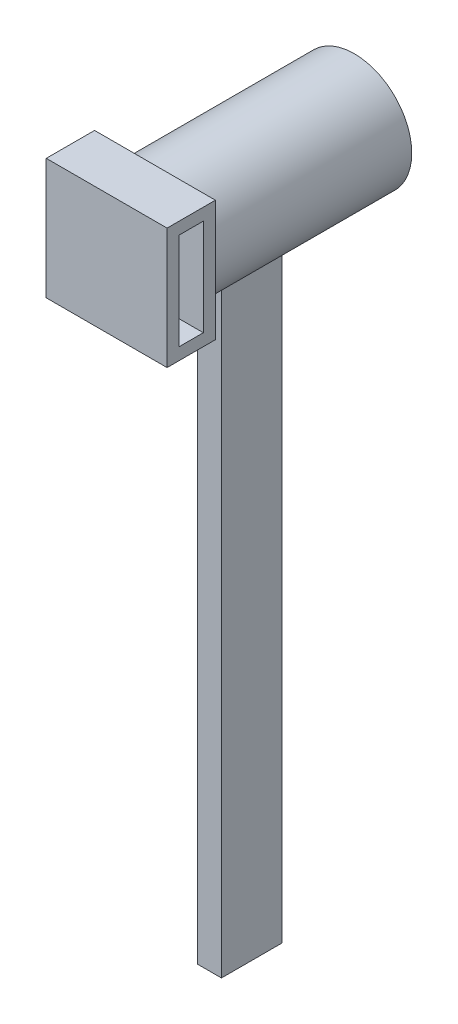
ISO-10303-21;
HEADER;
FILE_DESCRIPTION(('STEP AP214'),'2;1');
FILE_NAME('part.step','',(''),(''),'','','');
FILE_SCHEMA(('AUTOMOTIVE_DESIGN { 1 0 10303 214 1 1 1 1 }'));
ENDSEC;
DATA;
#1=APPLICATION_CONTEXT('core data for automotive mechanical design processes');
#2=APPLICATION_PROTOCOL_DEFINITION('international standard','automotive_design',2000,#1);
#3=PRODUCT_CONTEXT('',#1,'mechanical');
#4=PRODUCT('Part','Part','',(#3));
#5=PRODUCT_RELATED_PRODUCT_CATEGORY('part','',(#4));
#6=PRODUCT_DEFINITION_FORMATION('','',#4);
#7=PRODUCT_DEFINITION_CONTEXT('part definition',#1,'design');
#8=PRODUCT_DEFINITION('design','',#6,#7);
#9=PRODUCT_DEFINITION_SHAPE('','',#8);
#10=(LENGTH_UNIT() NAMED_UNIT(*) SI_UNIT(.MILLI.,.METRE.));
#11=(NAMED_UNIT(*) PLANE_ANGLE_UNIT() SI_UNIT($,.RADIAN.));
#12=(NAMED_UNIT(*) SI_UNIT($,.STERADIAN.) SOLID_ANGLE_UNIT());
#13=UNCERTAINTY_MEASURE_WITH_UNIT(LENGTH_MEASURE(1.E-05),#10,'distance_accuracy_value','');
#14=(GEOMETRIC_REPRESENTATION_CONTEXT(3) GLOBAL_UNCERTAINTY_ASSIGNED_CONTEXT((#13)) GLOBAL_UNIT_ASSIGNED_CONTEXT((#10,
#11,#12)) REPRESENTATION_CONTEXT('',''));
#15=CARTESIAN_POINT('',(0.,0.,0.));
#16=DIRECTION('',(0.,0.,1.));
#17=DIRECTION('',(1.,0.,0.));
#18=AXIS2_PLACEMENT_3D('',#15,#16,#17);
#19=CARTESIAN_POINT('',(0.,0.,0.));
#20=DIRECTION('',(0.,0.,1.));
#21=DIRECTION('',(1.,0.,0.));
#22=AXIS2_PLACEMENT_3D('',#19,#20,#21);
#23=PLANE('',#22);
#24=CARTESIAN_POINT('',(0.,0.,0.));
#25=DIRECTION('',(0.,0.,1.));
#26=DIRECTION('',(1.,0.,0.));
#27=AXIS2_PLACEMENT_3D('',#24,#25,#26);
#28=CIRCLE('',#27,4.75);
#29=CARTESIAN_POINT('',(4.75,0.,0.));
#30=VERTEX_POINT('',#29);
#31=EDGE_CURVE('E211',#30,#30,#28,.T.);
#32=ORIENTED_EDGE('',*,*,#31,.F.);
#33=EDGE_LOOP('',(#32));
#34=FACE_BOUND('',#33,.T.);
#35=ADVANCED_FACE('F39',(#34),#23,.F.);
#36=CARTESIAN_POINT('',(0.,0.,0.));
#37=DIRECTION('',(0.,0.,1.));
#38=DIRECTION('',(1.,0.,0.));
#39=AXIS2_PLACEMENT_3D('',#36,#37,#38);
#40=CYLINDRICAL_SURFACE('',#39,4.75);
#41=DIRECTION('',(0.,0.,1.));
#42=VECTOR('',#41,1.);
#43=CARTESIAN_POINT('',(1.,-4.64354390525168,0.));
#44=LINE('',#43,#42);
#45=CARTESIAN_POINT('',(1.,-4.64354390525168,7.));
#46=VERTEX_POINT('',#45);
#47=CARTESIAN_POINT('',(1.,-4.64354390525168,12.));
#48=VERTEX_POINT('',#47);
#49=EDGE_CURVE('E12',#46,#48,#44,.T.);
#50=ORIENTED_EDGE('',*,*,#49,.F.);
#51=CARTESIAN_POINT('',(0.,0.,7.));
#52=DIRECTION('',(0.,0.,-1.));
#53=DIRECTION('',(-1.,0.,0.));
#54=AXIS2_PLACEMENT_3D('',#51,#52,#53);
#55=CIRCLE('',#54,4.75);
#56=CARTESIAN_POINT('',(-1.,-4.64354390525168,7.));
#57=VERTEX_POINT('',#56);
#58=EDGE_CURVE('E318',#57,#46,#55,.F.);
#59=ORIENTED_EDGE('',*,*,#58,.F.);
#60=DIRECTION('',(0.,0.,1.));
#61=VECTOR('',#60,1.);
#62=CARTESIAN_POINT('',(-1.,-4.64354390525168,0.));
#63=LINE('',#62,#61);
#64=CARTESIAN_POINT('',(-1.,-4.64354390525168,12.));
#65=VERTEX_POINT('',#64);
#66=EDGE_CURVE('E321',#65,#57,#63,.F.);
#67=ORIENTED_EDGE('',*,*,#66,.F.);
#68=CARTESIAN_POINT('',(0.,0.,12.));
#69=DIRECTION('',(0.,0.,1.));
#70=DIRECTION('',(1.,0.,0.));
#71=AXIS2_PLACEMENT_3D('',#68,#69,#70);
#72=CIRCLE('',#71,4.75);
#73=EDGE_CURVE('E48',#48,#65,#72,.F.);
#74=ORIENTED_EDGE('',*,*,#73,.F.);
#75=EDGE_LOOP('',(#50,#59,#67,#74));
#76=FACE_BOUND('',#75,.T.);
#77=CARTESIAN_POINT('',(0.,0.,16.5));
#78=DIRECTION('',(0.,0.,1.));
#79=DIRECTION('',(1.,0.,0.));
#80=AXIS2_PLACEMENT_3D('',#77,#78,#79);
#81=CIRCLE('',#80,4.75);
#82=CARTESIAN_POINT('',(4.75,0.,16.5));
#83=VERTEX_POINT('',#82);
#84=EDGE_CURVE('E316',#83,#83,#81,.T.);
#85=ORIENTED_EDGE('',*,*,#84,.F.);
#86=EDGE_LOOP('',(#85));
#87=FACE_BOUND('',#86,.T.);
#88=ORIENTED_EDGE('',*,*,#31,.T.);
#89=EDGE_LOOP('',(#88));
#90=FACE_BOUND('',#89,.T.);
#91=ADVANCED_FACE('F41',(#76,#87,#90),#40,.T.);
#92=CARTESIAN_POINT('',(1.,-55.,12.));
#93=DIRECTION('',(1.,0.,0.));
#94=DIRECTION('',(0.,0.,-1.));
#95=AXIS2_PLACEMENT_3D('',#92,#93,#94);
#96=PLANE('',#95);
#97=DIRECTION('',(0.,1.,0.));
#98=VECTOR('',#97,1.);
#99=CARTESIAN_POINT('',(1.,-55.,7.));
#100=LINE('',#99,#98);
#101=CARTESIAN_POINT('',(1.,-55.,7.));
#102=VERTEX_POINT('',#101);
#103=EDGE_CURVE('E207',#102,#46,#100,.T.);
#104=ORIENTED_EDGE('',*,*,#103,.T.);
#105=ORIENTED_EDGE('',*,*,#49,.T.);
#106=DIRECTION('',(0.,1.,0.));
#107=VECTOR('',#106,1.);
#108=CARTESIAN_POINT('',(1.,-55.,12.));
#109=LINE('',#108,#107);
#110=CARTESIAN_POINT('',(1.,-55.,12.));
#111=VERTEX_POINT('',#110);
#112=EDGE_CURVE('E208',#111,#48,#109,.T.);
#113=ORIENTED_EDGE('',*,*,#112,.F.);
#114=DIRECTION('',(0.,0.,-1.));
#115=VECTOR('',#114,1.);
#116=CARTESIAN_POINT('',(1.,-55.,12.));
#117=LINE('',#116,#115);
#118=EDGE_CURVE('E195',#111,#102,#117,.T.);
#119=ORIENTED_EDGE('',*,*,#118,.T.);
#120=EDGE_LOOP('',(#104,#105,#113,#119));
#121=FACE_BOUND('',#120,.T.);
#122=ADVANCED_FACE('F246',(#121),#96,.T.);
#123=CARTESIAN_POINT('',(1.,-55.,12.));
#124=DIRECTION('',(0.,0.,1.));
#125=DIRECTION('',(1.,0.,0.));
#126=AXIS2_PLACEMENT_3D('',#123,#124,#125);
#127=PLANE('',#126);
#128=ORIENTED_EDGE('',*,*,#112,.T.);
#129=ORIENTED_EDGE('',*,*,#73,.T.);
#130=DIRECTION('',(0.,1.,0.));
#131=VECTOR('',#130,1.);
#132=CARTESIAN_POINT('',(-1.,-55.,12.));
#133=LINE('',#132,#131);
#134=CARTESIAN_POINT('',(-1.,-55.,12.));
#135=VERTEX_POINT('',#134);
#136=EDGE_CURVE('E212',#135,#65,#133,.T.);
#137=ORIENTED_EDGE('',*,*,#136,.F.);
#138=DIRECTION('',(1.,0.,0.));
#139=VECTOR('',#138,1.);
#140=CARTESIAN_POINT('',(1.,-55.,12.));
#141=LINE('',#140,#139);
#142=EDGE_CURVE('E204',#135,#111,#141,.T.);
#143=ORIENTED_EDGE('',*,*,#142,.T.);
#144=EDGE_LOOP('',(#128,#129,#137,#143));
#145=FACE_BOUND('',#144,.T.);
#146=ADVANCED_FACE('F249',(#145),#127,.T.);
#147=CARTESIAN_POINT('',(-1.,-55.,12.));
#148=DIRECTION('',(-1.,0.,0.));
#149=DIRECTION('',(0.,0.,1.));
#150=AXIS2_PLACEMENT_3D('',#147,#148,#149);
#151=PLANE('',#150);
#152=ORIENTED_EDGE('',*,*,#136,.T.);
#153=ORIENTED_EDGE('',*,*,#66,.T.);
#154=DIRECTION('',(0.,1.,0.));
#155=VECTOR('',#154,1.);
#156=CARTESIAN_POINT('',(-1.,-55.,7.));
#157=LINE('',#156,#155);
#158=CARTESIAN_POINT('',(-1.,-55.,7.));
#159=VERTEX_POINT('',#158);
#160=EDGE_CURVE('E215',#159,#57,#157,.T.);
#161=ORIENTED_EDGE('',*,*,#160,.F.);
#162=DIRECTION('',(0.,0.,1.));
#163=VECTOR('',#162,1.);
#164=CARTESIAN_POINT('',(-1.,-55.,12.));
#165=LINE('',#164,#163);
#166=EDGE_CURVE('E201',#159,#135,#165,.T.);
#167=ORIENTED_EDGE('',*,*,#166,.T.);
#168=EDGE_LOOP('',(#152,#153,#161,#167));
#169=FACE_BOUND('',#168,.T.);
#170=ADVANCED_FACE('F255',(#169),#151,.T.);
#171=CARTESIAN_POINT('',(1.,-55.,7.));
#172=DIRECTION('',(0.,0.,-1.));
#173=DIRECTION('',(-1.,0.,0.));
#174=AXIS2_PLACEMENT_3D('',#171,#172,#173);
#175=PLANE('',#174);
#176=ORIENTED_EDGE('',*,*,#160,.T.);
#177=ORIENTED_EDGE('',*,*,#58,.T.);
#178=ORIENTED_EDGE('',*,*,#103,.F.);
#179=DIRECTION('',(-1.,0.,0.));
#180=VECTOR('',#179,1.);
#181=CARTESIAN_POINT('',(1.,-55.,7.));
#182=LINE('',#181,#180);
#183=EDGE_CURVE('E198',#102,#159,#182,.T.);
#184=ORIENTED_EDGE('',*,*,#183,.T.);
#185=EDGE_LOOP('',(#176,#177,#178,#184));
#186=FACE_BOUND('',#185,.T.);
#187=ADVANCED_FACE('F251',(#186),#175,.T.);
#188=CARTESIAN_POINT('',(0.,-55.,0.));
#189=DIRECTION('',(0.,1.,0.));
#190=DIRECTION('',(0.,0.,1.));
#191=AXIS2_PLACEMENT_3D('',#188,#189,#190);
#192=PLANE('',#191);
#193=ORIENTED_EDGE('',*,*,#118,.F.);
#194=ORIENTED_EDGE('',*,*,#142,.F.);
#195=ORIENTED_EDGE('',*,*,#166,.F.);
#196=ORIENTED_EDGE('',*,*,#183,.F.);
#197=EDGE_LOOP('',(#193,#194,#195,#196));
#198=FACE_BOUND('',#197,.T.);
#199=ADVANCED_FACE('F254',(#198),#192,.F.);
#200=CARTESIAN_POINT('',(0.,0.,16.5));
#201=DIRECTION('',(0.,0.,1.));
#202=DIRECTION('',(1.,0.,0.));
#203=AXIS2_PLACEMENT_3D('',#200,#201,#202);
#204=PLANE('',#203);
#205=DIRECTION('',(0.,-1.,0.));
#206=VECTOR('',#205,1.);
#207=CARTESIAN_POINT('',(5.,0.,16.5));
#208=LINE('',#207,#206);
#209=CARTESIAN_POINT('',(5.,5.,16.5));
#210=VERTEX_POINT('',#209);
#211=CARTESIAN_POINT('',(5.,-5.,16.5));
#212=VERTEX_POINT('',#211);
#213=EDGE_CURVE('E165',#210,#212,#208,.T.);
#214=ORIENTED_EDGE('',*,*,#213,.T.);
#215=DIRECTION('',(1.,0.,0.));
#216=VECTOR('',#215,1.);
#217=CARTESIAN_POINT('',(0.,-5.,16.5));
#218=LINE('',#217,#216);
#219=CARTESIAN_POINT('',(-5.,-5.,16.5));
#220=VERTEX_POINT('',#219);
#221=EDGE_CURVE('E170',#220,#212,#218,.T.);
#222=ORIENTED_EDGE('',*,*,#221,.F.);
#223=DIRECTION('',(0.,-1.,0.));
#224=VECTOR('',#223,1.);
#225=CARTESIAN_POINT('',(-5.,0.,16.5));
#226=LINE('',#225,#224);
#227=CARTESIAN_POINT('',(-5.,5.,16.5));
#228=VERTEX_POINT('',#227);
#229=EDGE_CURVE('E183',#228,#220,#226,.T.);
#230=ORIENTED_EDGE('',*,*,#229,.F.);
#231=DIRECTION('',(1.,0.,0.));
#232=VECTOR('',#231,1.);
#233=CARTESIAN_POINT('',(0.,5.,16.5));
#234=LINE('',#233,#232);
#235=EDGE_CURVE('E180',#228,#210,#234,.T.);
#236=ORIENTED_EDGE('',*,*,#235,.T.);
#237=EDGE_LOOP('',(#214,#222,#230,#236));
#238=FACE_BOUND('',#237,.T.);
#239=ORIENTED_EDGE('',*,*,#84,.T.);
#240=EDGE_LOOP('',(#239));
#241=FACE_BOUND('',#240,.T.);
#242=ADVANCED_FACE('F265',(#238,#241),#204,.F.);
#243=CARTESIAN_POINT('',(5.,0.,20.5));
#244=DIRECTION('',(1.,0.,0.));
#245=DIRECTION('',(0.,0.,-1.));
#246=AXIS2_PLACEMENT_3D('',#243,#244,#245);
#247=PLANE('',#246);
#248=DIRECTION('',(0.,-1.,0.));
#249=VECTOR('',#248,1.);
#250=CARTESIAN_POINT('',(5.,0.,19.5));
#251=LINE('',#250,#249);
#252=CARTESIAN_POINT('',(5.,4.,19.5));
#253=VERTEX_POINT('',#252);
#254=CARTESIAN_POINT('',(5.,-4.,19.5));
#255=VERTEX_POINT('',#254);
#256=EDGE_CURVE('E135',#253,#255,#251,.T.);
#257=ORIENTED_EDGE('',*,*,#256,.F.);
#258=DIRECTION('',(0.,0.,1.));
#259=VECTOR('',#258,1.);
#260=CARTESIAN_POINT('',(5.,4.,20.5));
#261=LINE('',#260,#259);
#262=CARTESIAN_POINT('',(5.,4.,17.5));
#263=VERTEX_POINT('',#262);
#264=EDGE_CURVE('E162',#263,#253,#261,.T.);
#265=ORIENTED_EDGE('',*,*,#264,.F.);
#266=DIRECTION('',(0.,1.,0.));
#267=VECTOR('',#266,1.);
#268=CARTESIAN_POINT('',(5.,0.,17.5));
#269=LINE('',#268,#267);
#270=CARTESIAN_POINT('',(5.,-4.,17.5));
#271=VERTEX_POINT('',#270);
#272=EDGE_CURVE('E160',#271,#263,#269,.T.);
#273=ORIENTED_EDGE('',*,*,#272,.F.);
#274=DIRECTION('',(0.,0.,-1.));
#275=VECTOR('',#274,1.);
#276=CARTESIAN_POINT('',(5.,-4.,20.5));
#277=LINE('',#276,#275);
#278=EDGE_CURVE('E154',#255,#271,#277,.T.);
#279=ORIENTED_EDGE('',*,*,#278,.F.);
#280=EDGE_LOOP('',(#257,#265,#273,#279));
#281=FACE_BOUND('',#280,.T.);
#282=ORIENTED_EDGE('',*,*,#213,.F.);
#283=DIRECTION('',(0.,0.,-1.));
#284=VECTOR('',#283,1.);
#285=CARTESIAN_POINT('',(5.,5.,20.5));
#286=LINE('',#285,#284);
#287=CARTESIAN_POINT('',(5.,5.,20.5));
#288=VERTEX_POINT('',#287);
#289=EDGE_CURVE('E193',#288,#210,#286,.T.);
#290=ORIENTED_EDGE('',*,*,#289,.F.);
#291=DIRECTION('',(0.,-1.,0.));
#292=VECTOR('',#291,1.);
#293=CARTESIAN_POINT('',(5.,0.,20.5));
#294=LINE('',#293,#292);
#295=CARTESIAN_POINT('',(5.,-5.,20.5));
#296=VERTEX_POINT('',#295);
#297=EDGE_CURVE('E166',#288,#296,#294,.T.);
#298=ORIENTED_EDGE('',*,*,#297,.T.);
#299=DIRECTION('',(0.,0.,-1.));
#300=VECTOR('',#299,1.);
#301=CARTESIAN_POINT('',(5.,-5.,20.5));
#302=LINE('',#301,#300);
#303=EDGE_CURVE('E177',#296,#212,#302,.T.);
#304=ORIENTED_EDGE('',*,*,#303,.T.);
#305=EDGE_LOOP('',(#282,#290,#298,#304));
#306=FACE_BOUND('',#305,.T.);
#307=ADVANCED_FACE('F267',(#281,#306),#247,.T.);
#308=CARTESIAN_POINT('',(0.,5.,20.5));
#309=DIRECTION('',(0.,1.,0.));
#310=DIRECTION('',(0.,0.,1.));
#311=AXIS2_PLACEMENT_3D('',#308,#309,#310);
#312=PLANE('',#311);
#313=ORIENTED_EDGE('',*,*,#235,.F.);
#314=DIRECTION('',(0.,0.,-1.));
#315=VECTOR('',#314,1.);
#316=CARTESIAN_POINT('',(-5.,5.,20.5));
#317=LINE('',#316,#315);
#318=CARTESIAN_POINT('',(-5.,5.,20.5));
#319=VERTEX_POINT('',#318);
#320=EDGE_CURVE('E191',#319,#228,#317,.T.);
#321=ORIENTED_EDGE('',*,*,#320,.F.);
#322=DIRECTION('',(1.,0.,0.));
#323=VECTOR('',#322,1.);
#324=CARTESIAN_POINT('',(0.,5.,20.5));
#325=LINE('',#324,#323);
#326=EDGE_CURVE('E169',#319,#288,#325,.T.);
#327=ORIENTED_EDGE('',*,*,#326,.T.);
#328=ORIENTED_EDGE('',*,*,#289,.T.);
#329=EDGE_LOOP('',(#313,#321,#327,#328));
#330=FACE_BOUND('',#329,.T.);
#331=ADVANCED_FACE('F270',(#330),#312,.T.);
#332=CARTESIAN_POINT('',(-5.,0.,20.5));
#333=DIRECTION('',(1.,0.,0.));
#334=DIRECTION('',(0.,0.,-1.));
#335=AXIS2_PLACEMENT_3D('',#332,#333,#334);
#336=PLANE('',#335);
#337=DIRECTION('',(0.,0.,1.));
#338=VECTOR('',#337,1.);
#339=CARTESIAN_POINT('',(-5.,4.,19.5));
#340=LINE('',#339,#338);
#341=CARTESIAN_POINT('',(-5.,4.,17.5));
#342=VERTEX_POINT('',#341);
#343=CARTESIAN_POINT('',(-5.,4.,19.5));
#344=VERTEX_POINT('',#343);
#345=EDGE_CURVE('E138',#342,#344,#340,.T.);
#346=ORIENTED_EDGE('',*,*,#345,.T.);
#347=DIRECTION('',(0.,-1.,0.));
#348=VECTOR('',#347,1.);
#349=CARTESIAN_POINT('',(-5.,4.,19.5));
#350=LINE('',#349,#348);
#351=CARTESIAN_POINT('',(-5.,-4.,19.5));
#352=VERTEX_POINT('',#351);
#353=EDGE_CURVE('E132',#344,#352,#350,.T.);
#354=ORIENTED_EDGE('',*,*,#353,.T.);
#355=DIRECTION('',(0.,0.,-1.));
#356=VECTOR('',#355,1.);
#357=CARTESIAN_POINT('',(-5.,-4.,19.5));
#358=LINE('',#357,#356);
#359=CARTESIAN_POINT('',(-5.,-4.,17.5));
#360=VERTEX_POINT('',#359);
#361=EDGE_CURVE('E141',#352,#360,#358,.T.);
#362=ORIENTED_EDGE('',*,*,#361,.T.);
#363=DIRECTION('',(0.,1.,0.));
#364=VECTOR('',#363,1.);
#365=CARTESIAN_POINT('',(-5.,4.,17.5));
#366=LINE('',#365,#364);
#367=EDGE_CURVE('E63',#360,#342,#366,.T.);
#368=ORIENTED_EDGE('',*,*,#367,.T.);
#369=EDGE_LOOP('',(#346,#354,#362,#368));
#370=FACE_BOUND('',#369,.T.);
#371=ORIENTED_EDGE('',*,*,#229,.T.);
#372=DIRECTION('',(0.,0.,-1.));
#373=VECTOR('',#372,1.);
#374=CARTESIAN_POINT('',(-5.,-5.,20.5));
#375=LINE('',#374,#373);
#376=CARTESIAN_POINT('',(-5.,-5.,20.5));
#377=VERTEX_POINT('',#376);
#378=EDGE_CURVE('E188',#377,#220,#375,.T.);
#379=ORIENTED_EDGE('',*,*,#378,.F.);
#380=DIRECTION('',(0.,-1.,0.));
#381=VECTOR('',#380,1.);
#382=CARTESIAN_POINT('',(-5.,0.,20.5));
#383=LINE('',#382,#381);
#384=EDGE_CURVE('E173',#319,#377,#383,.T.);
#385=ORIENTED_EDGE('',*,*,#384,.F.);
#386=ORIENTED_EDGE('',*,*,#320,.T.);
#387=EDGE_LOOP('',(#371,#379,#385,#386));
#388=FACE_BOUND('',#387,.T.);
#389=ADVANCED_FACE('F145',(#370,#388),#336,.F.);
#390=CARTESIAN_POINT('',(0.,-5.,20.5));
#391=DIRECTION('',(0.,1.,0.));
#392=DIRECTION('',(0.,0.,1.));
#393=AXIS2_PLACEMENT_3D('',#390,#391,#392);
#394=PLANE('',#393);
#395=ORIENTED_EDGE('',*,*,#221,.T.);
#396=ORIENTED_EDGE('',*,*,#303,.F.);
#397=DIRECTION('',(1.,0.,0.));
#398=VECTOR('',#397,1.);
#399=CARTESIAN_POINT('',(0.,-5.,20.5));
#400=LINE('',#399,#398);
#401=EDGE_CURVE('E175',#377,#296,#400,.T.);
#402=ORIENTED_EDGE('',*,*,#401,.F.);
#403=ORIENTED_EDGE('',*,*,#378,.T.);
#404=EDGE_LOOP('',(#395,#396,#402,#403));
#405=FACE_BOUND('',#404,.T.);
#406=ADVANCED_FACE('F277',(#405),#394,.F.);
#407=CARTESIAN_POINT('',(0.,0.,20.5));
#408=DIRECTION('',(0.,0.,1.));
#409=DIRECTION('',(1.,0.,0.));
#410=AXIS2_PLACEMENT_3D('',#407,#408,#409);
#411=PLANE('',#410);
#412=ORIENTED_EDGE('',*,*,#297,.F.);
#413=ORIENTED_EDGE('',*,*,#326,.F.);
#414=ORIENTED_EDGE('',*,*,#384,.T.);
#415=ORIENTED_EDGE('',*,*,#401,.T.);
#416=EDGE_LOOP('',(#412,#413,#414,#415));
#417=FACE_BOUND('',#416,.T.);
#418=ADVANCED_FACE('F280',(#417),#411,.T.);
#419=CARTESIAN_POINT('',(-5.,4.,19.5));
#420=DIRECTION('',(0.,0.,1.));
#421=DIRECTION('',(1.,0.,0.));
#422=AXIS2_PLACEMENT_3D('',#419,#420,#421);
#423=PLANE('',#422);
#424=ORIENTED_EDGE('',*,*,#256,.T.);
#425=DIRECTION('',(1.,0.,0.));
#426=VECTOR('',#425,1.);
#427=CARTESIAN_POINT('',(-5.,-4.,19.5));
#428=LINE('',#427,#426);
#429=EDGE_CURVE('E55',#352,#255,#428,.T.);
#430=ORIENTED_EDGE('',*,*,#429,.F.);
#431=ORIENTED_EDGE('',*,*,#353,.F.);
#432=DIRECTION('',(1.,0.,0.));
#433=VECTOR('',#432,1.);
#434=CARTESIAN_POINT('',(-5.,4.,19.5));
#435=LINE('',#434,#433);
#436=EDGE_CURVE('E152',#344,#253,#435,.T.);
#437=ORIENTED_EDGE('',*,*,#436,.T.);
#438=EDGE_LOOP('',(#424,#430,#431,#437));
#439=FACE_BOUND('',#438,.T.);
#440=ADVANCED_FACE('F129',(#439),#423,.F.);
#441=CARTESIAN_POINT('',(-5.,4.,19.5));
#442=DIRECTION('',(0.,1.,0.));
#443=DIRECTION('',(0.,0.,1.));
#444=AXIS2_PLACEMENT_3D('',#441,#442,#443);
#445=PLANE('',#444);
#446=ORIENTED_EDGE('',*,*,#264,.T.);
#447=ORIENTED_EDGE('',*,*,#436,.F.);
#448=ORIENTED_EDGE('',*,*,#345,.F.);
#449=DIRECTION('',(1.,0.,0.));
#450=VECTOR('',#449,1.);
#451=CARTESIAN_POINT('',(-5.,4.,17.5));
#452=LINE('',#451,#450);
#453=EDGE_CURVE('E155',#342,#263,#452,.T.);
#454=ORIENTED_EDGE('',*,*,#453,.T.);
#455=EDGE_LOOP('',(#446,#447,#448,#454));
#456=FACE_BOUND('',#455,.T.);
#457=ADVANCED_FACE('F290',(#456),#445,.F.);
#458=CARTESIAN_POINT('',(-5.,4.,17.5));
#459=DIRECTION('',(0.,0.,-1.));
#460=DIRECTION('',(-1.,0.,0.));
#461=AXIS2_PLACEMENT_3D('',#458,#459,#460);
#462=PLANE('',#461);
#463=ORIENTED_EDGE('',*,*,#272,.T.);
#464=ORIENTED_EDGE('',*,*,#453,.F.);
#465=ORIENTED_EDGE('',*,*,#367,.F.);
#466=DIRECTION('',(1.,0.,0.));
#467=VECTOR('',#466,1.);
#468=CARTESIAN_POINT('',(-5.,-4.,17.5));
#469=LINE('',#468,#467);
#470=EDGE_CURVE('E137',#360,#271,#469,.T.);
#471=ORIENTED_EDGE('',*,*,#470,.T.);
#472=EDGE_LOOP('',(#463,#464,#465,#471));
#473=FACE_BOUND('',#472,.T.);
#474=ADVANCED_FACE('F293',(#473),#462,.F.);
#475=CARTESIAN_POINT('',(-5.,-4.,19.5));
#476=DIRECTION('',(0.,-1.,0.));
#477=DIRECTION('',(0.,0.,-1.));
#478=AXIS2_PLACEMENT_3D('',#475,#476,#477);
#479=PLANE('',#478);
#480=ORIENTED_EDGE('',*,*,#278,.T.);
#481=ORIENTED_EDGE('',*,*,#470,.F.);
#482=ORIENTED_EDGE('',*,*,#361,.F.);
#483=ORIENTED_EDGE('',*,*,#429,.T.);
#484=EDGE_LOOP('',(#480,#481,#482,#483));
#485=FACE_BOUND('',#484,.T.);
#486=ADVANCED_FACE('F142',(#485),#479,.F.);
#487=CLOSED_SHELL('',(#35,#91,#122,#146,#170,#187,#199,#242,#307,#331,#389,#406,#418,#440,#457,
#474,#486));
#488=MANIFOLD_SOLID_BREP('B2',#487);
#489=ADVANCED_BREP_SHAPE_REPRESENTATION('',(#18,#488),#14);
#490=SHAPE_DEFINITION_REPRESENTATION(#9,#489);
ENDSEC;
END-ISO-10303-21;
